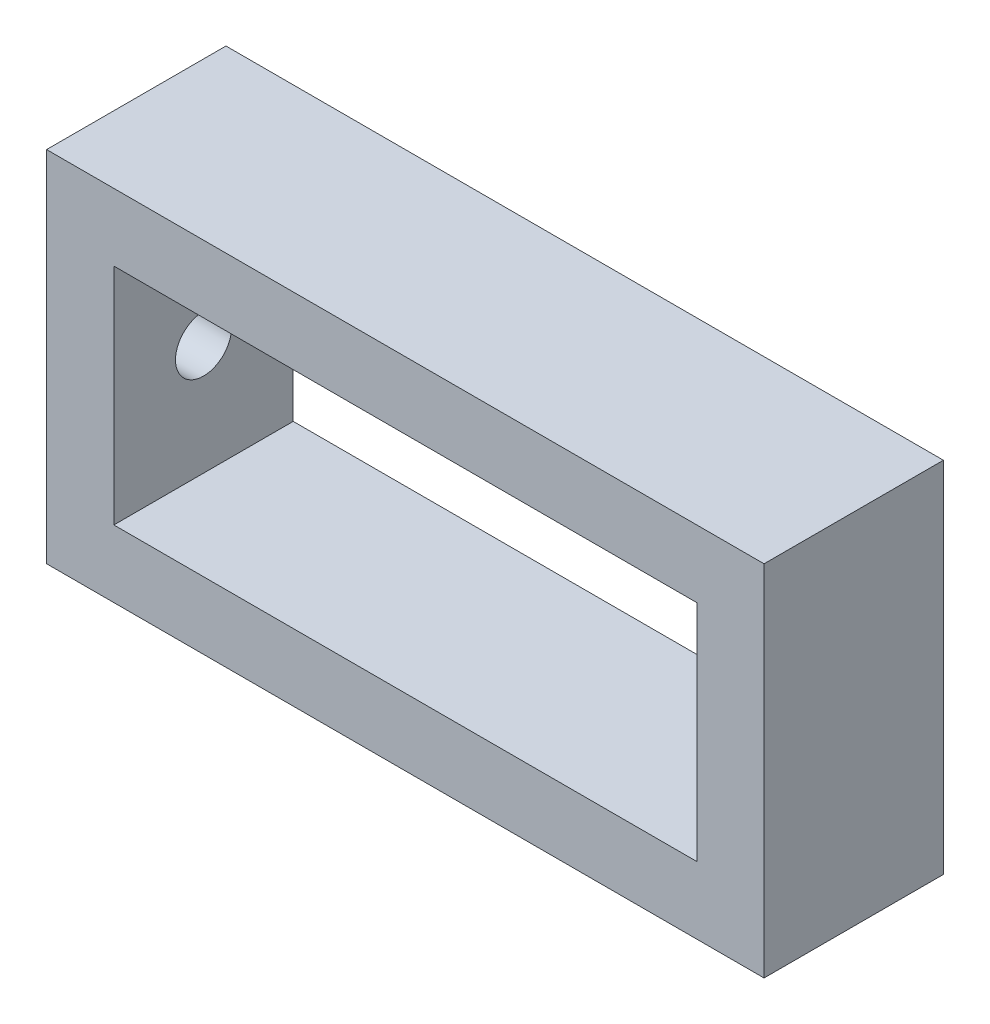
ISO-10303-21;
HEADER;
FILE_DESCRIPTION(('STEP AP214'),'2;1');
FILE_NAME('part.step','',(''),(''),'','','');
FILE_SCHEMA(('AUTOMOTIVE_DESIGN { 1 0 10303 214 1 1 1 1 }'));
ENDSEC;
DATA;
#1=APPLICATION_CONTEXT('core data for automotive mechanical design processes');
#2=APPLICATION_PROTOCOL_DEFINITION('international standard','automotive_design',2000,#1);
#3=PRODUCT_CONTEXT('',#1,'mechanical');
#4=PRODUCT('Part','Part','',(#3));
#5=PRODUCT_RELATED_PRODUCT_CATEGORY('part','',(#4));
#6=PRODUCT_DEFINITION_FORMATION('','',#4);
#7=PRODUCT_DEFINITION_CONTEXT('part definition',#1,'design');
#8=PRODUCT_DEFINITION('design','',#6,#7);
#9=PRODUCT_DEFINITION_SHAPE('','',#8);
#10=(LENGTH_UNIT() NAMED_UNIT(*) SI_UNIT(.MILLI.,.METRE.));
#11=(NAMED_UNIT(*) PLANE_ANGLE_UNIT() SI_UNIT($,.RADIAN.));
#12=(NAMED_UNIT(*) SI_UNIT($,.STERADIAN.) SOLID_ANGLE_UNIT());
#13=UNCERTAINTY_MEASURE_WITH_UNIT(LENGTH_MEASURE(1.E-05),#10,'distance_accuracy_value','');
#14=(GEOMETRIC_REPRESENTATION_CONTEXT(3) GLOBAL_UNCERTAINTY_ASSIGNED_CONTEXT((#13)) GLOBAL_UNIT_ASSIGNED_CONTEXT((#10,
#11,#12)) REPRESENTATION_CONTEXT('',''));
#15=CARTESIAN_POINT('',(0.,0.,0.));
#16=DIRECTION('',(0.,0.,1.));
#17=DIRECTION('',(1.,0.,0.));
#18=AXIS2_PLACEMENT_3D('',#15,#16,#17);
#19=CARTESIAN_POINT('',(0.,101.6,50.8));
#20=DIRECTION('',(0.,0.,-1.));
#21=DIRECTION('',(-1.,0.,0.));
#22=AXIS2_PLACEMENT_3D('',#19,#20,#21);
#23=PLANE('',#22);
#24=DIRECTION('',(0.,-1.,0.));
#25=VECTOR('',#24,1.);
#26=CARTESIAN_POINT('',(0.,0.,50.8));
#27=LINE('',#26,#25);
#28=CARTESIAN_POINT('',(0.,101.6,50.8));
#29=VERTEX_POINT('',#28);
#30=CARTESIAN_POINT('',(0.,0.,50.8));
#31=VERTEX_POINT('',#30);
#32=EDGE_CURVE('E227',#29,#31,#27,.T.);
#33=ORIENTED_EDGE('',*,*,#32,.T.);
#34=DIRECTION('',(1.,0.,0.));
#35=VECTOR('',#34,1.);
#36=CARTESIAN_POINT('',(0.,0.,50.8));
#37=LINE('',#36,#35);
#38=CARTESIAN_POINT('',(203.2,0.,50.8));
#39=VERTEX_POINT('',#38);
#40=EDGE_CURVE('E205',#31,#39,#37,.T.);
#41=ORIENTED_EDGE('',*,*,#40,.T.);
#42=DIRECTION('',(0.,1.,0.));
#43=VECTOR('',#42,1.);
#44=CARTESIAN_POINT('',(203.2,0.,50.8));
#45=LINE('',#44,#43);
#46=CARTESIAN_POINT('',(203.2,101.6,50.8));
#47=VERTEX_POINT('',#46);
#48=EDGE_CURVE('E201',#39,#47,#45,.T.);
#49=ORIENTED_EDGE('',*,*,#48,.T.);
#50=DIRECTION('',(-1.,0.,0.));
#51=VECTOR('',#50,1.);
#52=CARTESIAN_POINT('',(0.,101.6,50.8));
#53=LINE('',#52,#51);
#54=EDGE_CURVE('E204',#47,#29,#53,.T.);
#55=ORIENTED_EDGE('',*,*,#54,.T.);
#56=EDGE_LOOP('',(#33,#41,#49,#55));
#57=FACE_BOUND('',#56,.T.);
#58=DIRECTION('',(1.,0.,0.));
#59=VECTOR('',#58,1.);
#60=CARTESIAN_POINT('',(19.05,19.05,50.8));
#61=LINE('',#60,#59);
#62=CARTESIAN_POINT('',(19.05,19.05,50.8));
#63=VERTEX_POINT('',#62);
#64=CARTESIAN_POINT('',(184.15,19.05,50.8));
#65=VERTEX_POINT('',#64);
#66=EDGE_CURVE('E114',#63,#65,#61,.T.);
#67=ORIENTED_EDGE('',*,*,#66,.F.);
#68=DIRECTION('',(0.,-1.,0.));
#69=VECTOR('',#68,1.);
#70=CARTESIAN_POINT('',(19.05,19.05,50.8));
#71=LINE('',#70,#69);
#72=CARTESIAN_POINT('',(19.05,82.55,50.8));
#73=VERTEX_POINT('',#72);
#74=EDGE_CURVE('E137',#73,#63,#71,.T.);
#75=ORIENTED_EDGE('',*,*,#74,.F.);
#76=DIRECTION('',(-1.,0.,0.));
#77=VECTOR('',#76,1.);
#78=CARTESIAN_POINT('',(19.05,82.55,50.8));
#79=LINE('',#78,#77);
#80=CARTESIAN_POINT('',(184.15,82.55,50.8));
#81=VERTEX_POINT('',#80);
#82=EDGE_CURVE('E135',#81,#73,#79,.T.);
#83=ORIENTED_EDGE('',*,*,#82,.F.);
#84=DIRECTION('',(0.,1.,0.));
#85=VECTOR('',#84,1.);
#86=CARTESIAN_POINT('',(184.15,19.05,50.8));
#87=LINE('',#86,#85);
#88=EDGE_CURVE('E123',#65,#81,#87,.T.);
#89=ORIENTED_EDGE('',*,*,#88,.F.);
#90=EDGE_LOOP('',(#67,#75,#83,#89));
#91=FACE_BOUND('',#90,.T.);
#92=ADVANCED_FACE('F47',(#57,#91),#23,.F.);
#93=CARTESIAN_POINT('',(0.,101.6,0.));
#94=DIRECTION('',(0.,0.,-1.));
#95=DIRECTION('',(-1.,0.,0.));
#96=AXIS2_PLACEMENT_3D('',#93,#94,#95);
#97=PLANE('',#96);
#98=DIRECTION('',(0.,-1.,0.));
#99=VECTOR('',#98,1.);
#100=CARTESIAN_POINT('',(0.,0.,0.));
#101=LINE('',#100,#99);
#102=CARTESIAN_POINT('',(0.,101.6,0.));
#103=VERTEX_POINT('',#102);
#104=CARTESIAN_POINT('',(0.,0.,0.));
#105=VERTEX_POINT('',#104);
#106=EDGE_CURVE('E131',#103,#105,#101,.T.);
#107=ORIENTED_EDGE('',*,*,#106,.F.);
#108=DIRECTION('',(-1.,0.,0.));
#109=VECTOR('',#108,1.);
#110=CARTESIAN_POINT('',(0.,101.6,0.));
#111=LINE('',#110,#109);
#112=CARTESIAN_POINT('',(203.2,101.6,0.));
#113=VERTEX_POINT('',#112);
#114=EDGE_CURVE('E222',#113,#103,#111,.T.);
#115=ORIENTED_EDGE('',*,*,#114,.F.);
#116=DIRECTION('',(0.,1.,0.));
#117=VECTOR('',#116,1.);
#118=CARTESIAN_POINT('',(203.2,0.,0.));
#119=LINE('',#118,#117);
#120=CARTESIAN_POINT('',(203.2,0.,0.));
#121=VERTEX_POINT('',#120);
#122=EDGE_CURVE('E190',#121,#113,#119,.T.);
#123=ORIENTED_EDGE('',*,*,#122,.F.);
#124=DIRECTION('',(1.,0.,0.));
#125=VECTOR('',#124,1.);
#126=CARTESIAN_POINT('',(0.,0.,0.));
#127=LINE('',#126,#125);
#128=EDGE_CURVE('E186',#105,#121,#127,.T.);
#129=ORIENTED_EDGE('',*,*,#128,.F.);
#130=EDGE_LOOP('',(#107,#115,#123,#129));
#131=FACE_BOUND('',#130,.T.);
#132=DIRECTION('',(0.,-1.,0.));
#133=VECTOR('',#132,1.);
#134=CARTESIAN_POINT('',(19.05,19.05,0.));
#135=LINE('',#134,#133);
#136=CARTESIAN_POINT('',(19.05,82.55,0.));
#137=VERTEX_POINT('',#136);
#138=CARTESIAN_POINT('',(19.05,19.05,0.));
#139=VERTEX_POINT('',#138);
#140=EDGE_CURVE('E124',#137,#139,#135,.T.);
#141=ORIENTED_EDGE('',*,*,#140,.T.);
#142=DIRECTION('',(1.,0.,0.));
#143=VECTOR('',#142,1.);
#144=CARTESIAN_POINT('',(19.05,19.05,0.));
#145=LINE('',#144,#143);
#146=CARTESIAN_POINT('',(184.15,19.05,0.));
#147=VERTEX_POINT('',#146);
#148=EDGE_CURVE('E72',#139,#147,#145,.T.);
#149=ORIENTED_EDGE('',*,*,#148,.T.);
#150=DIRECTION('',(0.,1.,0.));
#151=VECTOR('',#150,1.);
#152=CARTESIAN_POINT('',(184.15,19.05,0.));
#153=LINE('',#152,#151);
#154=CARTESIAN_POINT('',(184.15,82.55,0.));
#155=VERTEX_POINT('',#154);
#156=EDGE_CURVE('E130',#147,#155,#153,.T.);
#157=ORIENTED_EDGE('',*,*,#156,.T.);
#158=DIRECTION('',(-1.,0.,0.));
#159=VECTOR('',#158,1.);
#160=CARTESIAN_POINT('',(19.05,82.55,0.));
#161=LINE('',#160,#159);
#162=EDGE_CURVE('E174',#155,#137,#161,.T.);
#163=ORIENTED_EDGE('',*,*,#162,.T.);
#164=EDGE_LOOP('',(#141,#149,#157,#163));
#165=FACE_BOUND('',#164,.T.);
#166=ADVANCED_FACE('F252',(#131,#165),#97,.T.);
#167=CARTESIAN_POINT('',(0.,0.,50.8));
#168=DIRECTION('',(1.,0.,0.));
#169=DIRECTION('',(0.,0.,-1.));
#170=AXIS2_PLACEMENT_3D('',#167,#168,#169);
#171=PLANE('',#170);
#172=CARTESIAN_POINT('',(0.,50.8,25.4));
#173=DIRECTION('',(-1.,0.,0.));
#174=DIRECTION('',(0.,0.,1.));
#175=AXIS2_PLACEMENT_3D('',#172,#173,#174);
#176=CIRCLE('',#175,7.93750000000001);
#177=CARTESIAN_POINT('',(0.,50.8,33.3375));
#178=VERTEX_POINT('',#177);
#179=EDGE_CURVE('E285',#178,#178,#176,.T.);
#180=ORIENTED_EDGE('',*,*,#179,.F.);
#181=EDGE_LOOP('',(#180));
#182=FACE_BOUND('',#181,.T.);
#183=ORIENTED_EDGE('',*,*,#106,.T.);
#184=DIRECTION('',(0.,0.,-1.));
#185=VECTOR('',#184,1.);
#186=CARTESIAN_POINT('',(0.,0.,50.8));
#187=LINE('',#186,#185);
#188=EDGE_CURVE('E12',#31,#105,#187,.T.);
#189=ORIENTED_EDGE('',*,*,#188,.F.);
#190=ORIENTED_EDGE('',*,*,#32,.F.);
#191=DIRECTION('',(0.,0.,-1.));
#192=VECTOR('',#191,1.);
#193=CARTESIAN_POINT('',(0.,101.6,50.8));
#194=LINE('',#193,#192);
#195=EDGE_CURVE('E208',#29,#103,#194,.T.);
#196=ORIENTED_EDGE('',*,*,#195,.T.);
#197=EDGE_LOOP('',(#183,#189,#190,#196));
#198=FACE_BOUND('',#197,.T.);
#199=ADVANCED_FACE('F49',(#182,#198),#171,.F.);
#200=CARTESIAN_POINT('',(0.,0.,50.8));
#201=DIRECTION('',(0.,1.,0.));
#202=DIRECTION('',(0.,0.,1.));
#203=AXIS2_PLACEMENT_3D('',#200,#201,#202);
#204=PLANE('',#203);
#205=ORIENTED_EDGE('',*,*,#128,.T.);
#206=DIRECTION('',(0.,0.,-1.));
#207=VECTOR('',#206,1.);
#208=CARTESIAN_POINT('',(203.2,0.,50.8));
#209=LINE('',#208,#207);
#210=EDGE_CURVE('E57',#39,#121,#209,.T.);
#211=ORIENTED_EDGE('',*,*,#210,.F.);
#212=ORIENTED_EDGE('',*,*,#40,.F.);
#213=ORIENTED_EDGE('',*,*,#188,.T.);
#214=EDGE_LOOP('',(#205,#211,#212,#213));
#215=FACE_BOUND('',#214,.T.);
#216=ADVANCED_FACE('F268',(#215),#204,.F.);
#217=CARTESIAN_POINT('',(203.2,0.,50.8));
#218=DIRECTION('',(-1.,0.,0.));
#219=DIRECTION('',(0.,0.,1.));
#220=AXIS2_PLACEMENT_3D('',#217,#218,#219);
#221=PLANE('',#220);
#222=ORIENTED_EDGE('',*,*,#122,.T.);
#223=DIRECTION('',(0.,0.,-1.));
#224=VECTOR('',#223,1.);
#225=CARTESIAN_POINT('',(203.2,101.6,50.8));
#226=LINE('',#225,#224);
#227=EDGE_CURVE('E214',#47,#113,#226,.T.);
#228=ORIENTED_EDGE('',*,*,#227,.F.);
#229=ORIENTED_EDGE('',*,*,#48,.F.);
#230=ORIENTED_EDGE('',*,*,#210,.T.);
#231=EDGE_LOOP('',(#222,#228,#229,#230));
#232=FACE_BOUND('',#231,.T.);
#233=ADVANCED_FACE('F265',(#232),#221,.F.);
#234=CARTESIAN_POINT('',(0.,101.6,50.8));
#235=DIRECTION('',(0.,-1.,0.));
#236=DIRECTION('',(0.,0.,-1.));
#237=AXIS2_PLACEMENT_3D('',#234,#235,#236);
#238=PLANE('',#237);
#239=ORIENTED_EDGE('',*,*,#114,.T.);
#240=ORIENTED_EDGE('',*,*,#195,.F.);
#241=ORIENTED_EDGE('',*,*,#54,.F.);
#242=ORIENTED_EDGE('',*,*,#227,.T.);
#243=EDGE_LOOP('',(#239,#240,#241,#242));
#244=FACE_BOUND('',#243,.T.);
#245=ADVANCED_FACE('F262',(#244),#238,.F.);
#246=CARTESIAN_POINT('',(19.05,19.05,50.8));
#247=DIRECTION('',(0.,1.,0.));
#248=DIRECTION('',(0.,0.,1.));
#249=AXIS2_PLACEMENT_3D('',#246,#247,#248);
#250=PLANE('',#249);
#251=ORIENTED_EDGE('',*,*,#148,.F.);
#252=DIRECTION('',(0.,0.,-1.));
#253=VECTOR('',#252,1.);
#254=CARTESIAN_POINT('',(19.05,19.05,50.8));
#255=LINE('',#254,#253);
#256=EDGE_CURVE('E118',#63,#139,#255,.T.);
#257=ORIENTED_EDGE('',*,*,#256,.F.);
#258=ORIENTED_EDGE('',*,*,#66,.T.);
#259=DIRECTION('',(0.,0.,-1.));
#260=VECTOR('',#259,1.);
#261=CARTESIAN_POINT('',(184.15,19.05,50.8));
#262=LINE('',#261,#260);
#263=EDGE_CURVE('E117',#65,#147,#262,.T.);
#264=ORIENTED_EDGE('',*,*,#263,.T.);
#265=EDGE_LOOP('',(#251,#257,#258,#264));
#266=FACE_BOUND('',#265,.T.);
#267=ADVANCED_FACE('F116',(#266),#250,.T.);
#268=CARTESIAN_POINT('',(184.15,19.05,50.8));
#269=DIRECTION('',(-1.,0.,0.));
#270=DIRECTION('',(0.,0.,1.));
#271=AXIS2_PLACEMENT_3D('',#268,#269,#270);
#272=PLANE('',#271);
#273=ORIENTED_EDGE('',*,*,#156,.F.);
#274=ORIENTED_EDGE('',*,*,#263,.F.);
#275=ORIENTED_EDGE('',*,*,#88,.T.);
#276=DIRECTION('',(0.,0.,-1.));
#277=VECTOR('',#276,1.);
#278=CARTESIAN_POINT('',(184.15,82.55,50.8));
#279=LINE('',#278,#277);
#280=EDGE_CURVE('E132',#81,#155,#279,.T.);
#281=ORIENTED_EDGE('',*,*,#280,.T.);
#282=EDGE_LOOP('',(#273,#274,#275,#281));
#283=FACE_BOUND('',#282,.T.);
#284=ADVANCED_FACE('F127',(#283),#272,.T.);
#285=CARTESIAN_POINT('',(19.05,82.55,50.8));
#286=DIRECTION('',(0.,-1.,0.));
#287=DIRECTION('',(0.,0.,-1.));
#288=AXIS2_PLACEMENT_3D('',#285,#286,#287);
#289=PLANE('',#288);
#290=ORIENTED_EDGE('',*,*,#162,.F.);
#291=ORIENTED_EDGE('',*,*,#280,.F.);
#292=ORIENTED_EDGE('',*,*,#82,.T.);
#293=DIRECTION('',(0.,0.,-1.));
#294=VECTOR('',#293,1.);
#295=CARTESIAN_POINT('',(19.05,82.55,50.8));
#296=LINE('',#295,#294);
#297=EDGE_CURVE('E64',#73,#137,#296,.T.);
#298=ORIENTED_EDGE('',*,*,#297,.T.);
#299=EDGE_LOOP('',(#290,#291,#292,#298));
#300=FACE_BOUND('',#299,.T.);
#301=ADVANCED_FACE('F240',(#300),#289,.T.);
#302=CARTESIAN_POINT('',(19.05,19.05,50.8));
#303=DIRECTION('',(1.,0.,0.));
#304=DIRECTION('',(0.,0.,-1.));
#305=AXIS2_PLACEMENT_3D('',#302,#303,#304);
#306=PLANE('',#305);
#307=CARTESIAN_POINT('',(19.05,50.8,25.4));
#308=DIRECTION('',(1.,0.,0.));
#309=DIRECTION('',(0.,0.,-1.));
#310=AXIS2_PLACEMENT_3D('',#307,#308,#309);
#311=CIRCLE('',#310,7.93750000000001);
#312=CARTESIAN_POINT('',(19.05,50.8,17.4625));
#313=VERTEX_POINT('',#312);
#314=EDGE_CURVE('E51',#313,#313,#311,.T.);
#315=ORIENTED_EDGE('',*,*,#314,.F.);
#316=EDGE_LOOP('',(#315));
#317=FACE_BOUND('',#316,.T.);
#318=ORIENTED_EDGE('',*,*,#140,.F.);
#319=ORIENTED_EDGE('',*,*,#297,.F.);
#320=ORIENTED_EDGE('',*,*,#74,.T.);
#321=ORIENTED_EDGE('',*,*,#256,.T.);
#322=EDGE_LOOP('',(#318,#319,#320,#321));
#323=FACE_BOUND('',#322,.T.);
#324=ADVANCED_FACE('F236',(#317,#323),#306,.T.);
#325=CARTESIAN_POINT('',(50.8,50.8,25.4));
#326=DIRECTION('',(-1.,0.,0.));
#327=DIRECTION('',(0.,0.,1.));
#328=AXIS2_PLACEMENT_3D('',#325,#326,#327);
#329=CYLINDRICAL_SURFACE('',#328,7.93750000000001);
#330=ORIENTED_EDGE('',*,*,#314,.T.);
#331=EDGE_LOOP('',(#330));
#332=FACE_BOUND('',#331,.T.);
#333=ORIENTED_EDGE('',*,*,#179,.T.);
#334=EDGE_LOOP('',(#333));
#335=FACE_BOUND('',#334,.T.);
#336=ADVANCED_FACE('F239',(#332,#335),#329,.F.);
#337=CLOSED_SHELL('',(#92,#166,#199,#216,#233,#245,#267,#284,#301,#324,#336));
#338=MANIFOLD_SOLID_BREP('B2',#337);
#339=ADVANCED_BREP_SHAPE_REPRESENTATION('',(#18,#338),#14);
#340=SHAPE_DEFINITION_REPRESENTATION(#9,#339);
ENDSEC;
END-ISO-10303-21;
